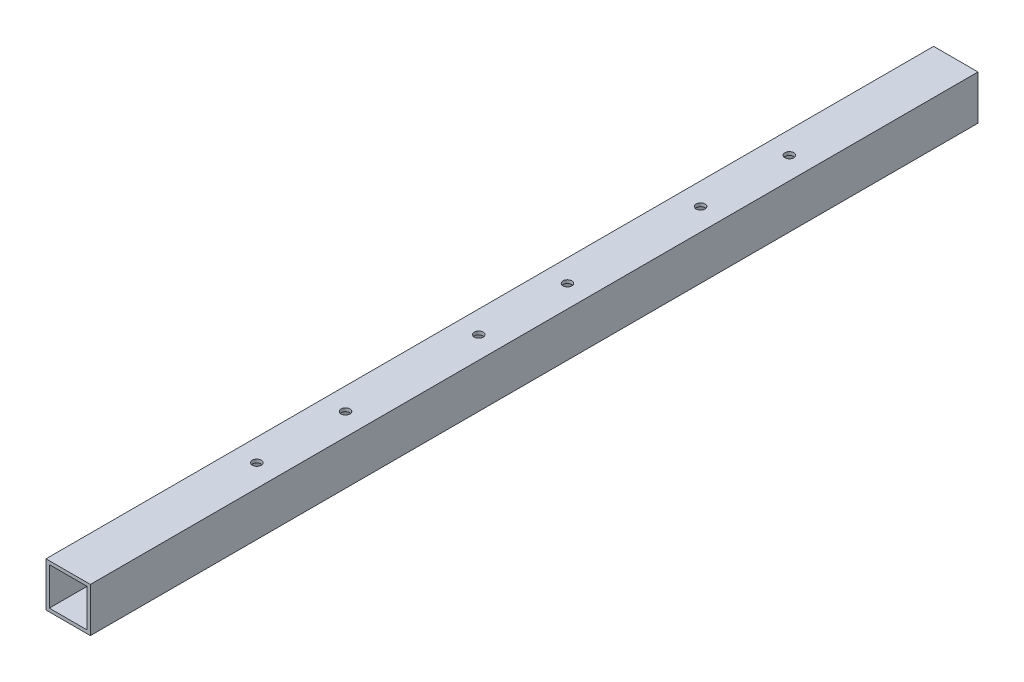
ISO-10303-21;
HEADER;
FILE_DESCRIPTION(('STEP AP214'),'2;1');
FILE_NAME('part.step','',(''),(''),'','','');
FILE_SCHEMA(('AUTOMOTIVE_DESIGN { 1 0 10303 214 1 1 1 1 }'));
ENDSEC;
DATA;
#1=APPLICATION_CONTEXT('core data for automotive mechanical design processes');
#2=APPLICATION_PROTOCOL_DEFINITION('international standard','automotive_design',2000,#1);
#3=PRODUCT_CONTEXT('',#1,'mechanical');
#4=PRODUCT('Part','Part','',(#3));
#5=PRODUCT_RELATED_PRODUCT_CATEGORY('part','',(#4));
#6=PRODUCT_DEFINITION_FORMATION('','',#4);
#7=PRODUCT_DEFINITION_CONTEXT('part definition',#1,'design');
#8=PRODUCT_DEFINITION('design','',#6,#7);
#9=PRODUCT_DEFINITION_SHAPE('','',#8);
#10=(LENGTH_UNIT() NAMED_UNIT(*) SI_UNIT(.MILLI.,.METRE.));
#11=(NAMED_UNIT(*) PLANE_ANGLE_UNIT() SI_UNIT($,.RADIAN.));
#12=(NAMED_UNIT(*) SI_UNIT($,.STERADIAN.) SOLID_ANGLE_UNIT());
#13=UNCERTAINTY_MEASURE_WITH_UNIT(LENGTH_MEASURE(1.E-05),#10,'distance_accuracy_value','');
#14=(GEOMETRIC_REPRESENTATION_CONTEXT(3) GLOBAL_UNCERTAINTY_ASSIGNED_CONTEXT((#13)) GLOBAL_UNIT_ASSIGNED_CONTEXT((#10,
#11,#12)) REPRESENTATION_CONTEXT('',''));
#15=CARTESIAN_POINT('',(0.,0.,0.));
#16=DIRECTION('',(0.,0.,1.));
#17=DIRECTION('',(1.,0.,0.));
#18=AXIS2_PLACEMENT_3D('',#15,#16,#17);
#19=CARTESIAN_POINT('',(0.,-15.,275.));
#20=DIRECTION('',(0.,1.,0.));
#21=DIRECTION('',(0.,0.,1.));
#22=AXIS2_PLACEMENT_3D('',#19,#20,#21);
#23=CYLINDRICAL_SURFACE('',#22,2.);
#24=CARTESIAN_POINT('',(0.,10.,275.));
#25=DIRECTION('',(0.,1.,0.));
#26=DIRECTION('',(0.,0.,1.));
#27=AXIS2_PLACEMENT_3D('',#24,#25,#26);
#28=CIRCLE('',#27,2.);
#29=CARTESIAN_POINT('',(0.,10.,277.));
#30=VERTEX_POINT('',#29);
#31=EDGE_CURVE('E46',#30,#30,#28,.T.);
#32=ORIENTED_EDGE('',*,*,#31,.T.);
#33=EDGE_LOOP('',(#32));
#34=FACE_BOUND('',#33,.T.);
#35=CARTESIAN_POINT('',(0.,8.5,275.));
#36=DIRECTION('',(0.,1.,0.));
#37=DIRECTION('',(0.,0.,1.));
#38=AXIS2_PLACEMENT_3D('',#35,#36,#37);
#39=CIRCLE('',#38,2.);
#40=CARTESIAN_POINT('',(0.,8.5,277.));
#41=VERTEX_POINT('',#40);
#42=EDGE_CURVE('E11',#41,#41,#39,.T.);
#43=ORIENTED_EDGE('',*,*,#42,.F.);
#44=EDGE_LOOP('',(#43));
#45=FACE_BOUND('',#44,.T.);
#46=ADVANCED_FACE('F38',(#34,#45),#23,.F.);
#47=CARTESIAN_POINT('',(0.,-15.,275.));
#48=DIRECTION('',(0.,1.,0.));
#49=DIRECTION('',(0.,0.,1.));
#50=AXIS2_PLACEMENT_3D('',#47,#48,#49);
#51=CYLINDRICAL_SURFACE('',#50,2.);
#52=CARTESIAN_POINT('',(0.,-8.5,275.));
#53=DIRECTION('',(0.,-1.,0.));
#54=DIRECTION('',(0.,0.,-1.));
#55=AXIS2_PLACEMENT_3D('',#52,#53,#54);
#56=CIRCLE('',#55,2.);
#57=CARTESIAN_POINT('',(0.,-8.5,273.));
#58=VERTEX_POINT('',#57);
#59=EDGE_CURVE('E174',#58,#58,#56,.T.);
#60=ORIENTED_EDGE('',*,*,#59,.F.);
#61=EDGE_LOOP('',(#60));
#62=FACE_BOUND('',#61,.T.);
#63=CARTESIAN_POINT('',(0.,-10.,275.));
#64=DIRECTION('',(0.,1.,0.));
#65=DIRECTION('',(0.,0.,1.));
#66=AXIS2_PLACEMENT_3D('',#63,#64,#65);
#67=CIRCLE('',#66,2.);
#68=CARTESIAN_POINT('',(0.,-10.,277.));
#69=VERTEX_POINT('',#68);
#70=EDGE_CURVE('E187',#69,#69,#67,.T.);
#71=ORIENTED_EDGE('',*,*,#70,.F.);
#72=EDGE_LOOP('',(#71));
#73=FACE_BOUND('',#72,.T.);
#74=ADVANCED_FACE('F261',(#62,#73),#51,.F.);
#75=CARTESIAN_POINT('',(10.,10.,400.));
#76=DIRECTION('',(-1.,0.,0.));
#77=DIRECTION('',(0.,0.,1.));
#78=AXIS2_PLACEMENT_3D('',#75,#76,#77);
#79=PLANE('',#78);
#80=DIRECTION('',(0.,1.,0.));
#81=VECTOR('',#80,1.);
#82=CARTESIAN_POINT('',(10.,10.,0.));
#83=LINE('',#82,#81);
#84=CARTESIAN_POINT('',(10.,-10.,0.));
#85=VERTEX_POINT('',#84);
#86=CARTESIAN_POINT('',(10.,10.,0.));
#87=VERTEX_POINT('',#86);
#88=EDGE_CURVE('E141',#85,#87,#83,.T.);
#89=ORIENTED_EDGE('',*,*,#88,.T.);
#90=DIRECTION('',(0.,0.,-1.));
#91=VECTOR('',#90,1.);
#92=CARTESIAN_POINT('',(10.,10.,400.));
#93=LINE('',#92,#91);
#94=CARTESIAN_POINT('',(10.,10.,400.));
#95=VERTEX_POINT('',#94);
#96=EDGE_CURVE('E171',#95,#87,#93,.T.);
#97=ORIENTED_EDGE('',*,*,#96,.F.);
#98=DIRECTION('',(0.,1.,0.));
#99=VECTOR('',#98,1.);
#100=CARTESIAN_POINT('',(10.,10.,400.));
#101=LINE('',#100,#99);
#102=CARTESIAN_POINT('',(10.,-10.,400.));
#103=VERTEX_POINT('',#102);
#104=EDGE_CURVE('E145',#103,#95,#101,.T.);
#105=ORIENTED_EDGE('',*,*,#104,.F.);
#106=DIRECTION('',(0.,0.,-1.));
#107=VECTOR('',#106,1.);
#108=CARTESIAN_POINT('',(10.,-10.,400.));
#109=LINE('',#108,#107);
#110=EDGE_CURVE('E155',#103,#85,#109,.T.);
#111=ORIENTED_EDGE('',*,*,#110,.T.);
#112=EDGE_LOOP('',(#89,#97,#105,#111));
#113=FACE_BOUND('',#112,.T.);
#114=ADVANCED_FACE('F266',(#113),#79,.F.);
#115=CARTESIAN_POINT('',(-10.,10.,400.));
#116=DIRECTION('',(0.,-1.,0.));
#117=DIRECTION('',(0.,0.,-1.));
#118=AXIS2_PLACEMENT_3D('',#115,#116,#117);
#119=PLANE('',#118);
#120=CARTESIAN_POINT('',(0.,10.,215.));
#121=DIRECTION('',(0.,1.,0.));
#122=DIRECTION('',(0.,0.,1.));
#123=AXIS2_PLACEMENT_3D('',#120,#121,#122);
#124=CIRCLE('',#123,2.);
#125=CARTESIAN_POINT('',(0.,10.,217.));
#126=VERTEX_POINT('',#125);
#127=EDGE_CURVE('E194',#126,#126,#124,.T.);
#128=ORIENTED_EDGE('',*,*,#127,.F.);
#129=EDGE_LOOP('',(#128));
#130=FACE_BOUND('',#129,.T.);
#131=CARTESIAN_POINT('',(0.,10.,315.));
#132=DIRECTION('',(0.,1.,0.));
#133=DIRECTION('',(0.,0.,1.));
#134=AXIS2_PLACEMENT_3D('',#131,#132,#133);
#135=CIRCLE('',#134,2.);
#136=CARTESIAN_POINT('',(0.,10.,317.));
#137=VERTEX_POINT('',#136);
#138=EDGE_CURVE('E201',#137,#137,#135,.T.);
#139=ORIENTED_EDGE('',*,*,#138,.F.);
#140=EDGE_LOOP('',(#139));
#141=FACE_BOUND('',#140,.T.);
#142=CARTESIAN_POINT('',(0.,10.,175.));
#143=DIRECTION('',(0.,1.,0.));
#144=DIRECTION('',(0.,0.,1.));
#145=AXIS2_PLACEMENT_3D('',#142,#143,#144);
#146=CIRCLE('',#145,2.);
#147=CARTESIAN_POINT('',(0.,10.,177.));
#148=VERTEX_POINT('',#147);
#149=EDGE_CURVE('E216',#148,#148,#146,.T.);
#150=ORIENTED_EDGE('',*,*,#149,.F.);
#151=EDGE_LOOP('',(#150));
#152=FACE_BOUND('',#151,.T.);
#153=CARTESIAN_POINT('',(0.,10.,115.));
#154=DIRECTION('',(0.,1.,0.));
#155=DIRECTION('',(0.,0.,1.));
#156=AXIS2_PLACEMENT_3D('',#153,#154,#155);
#157=CIRCLE('',#156,2.);
#158=CARTESIAN_POINT('',(0.,10.,117.));
#159=VERTEX_POINT('',#158);
#160=EDGE_CURVE('E184',#159,#159,#157,.T.);
#161=ORIENTED_EDGE('',*,*,#160,.F.);
#162=EDGE_LOOP('',(#161));
#163=FACE_BOUND('',#162,.T.);
#164=CARTESIAN_POINT('',(0.,10.,75.));
#165=DIRECTION('',(0.,1.,0.));
#166=DIRECTION('',(0.,0.,1.));
#167=AXIS2_PLACEMENT_3D('',#164,#165,#166);
#168=CIRCLE('',#167,2.);
#169=CARTESIAN_POINT('',(0.,10.,77.));
#170=VERTEX_POINT('',#169);
#171=EDGE_CURVE('E179',#170,#170,#168,.T.);
#172=ORIENTED_EDGE('',*,*,#171,.F.);
#173=EDGE_LOOP('',(#172));
#174=FACE_BOUND('',#173,.T.);
#175=DIRECTION('',(-1.,0.,0.));
#176=VECTOR('',#175,1.);
#177=CARTESIAN_POINT('',(-10.,10.,0.));
#178=LINE('',#177,#176);
#179=CARTESIAN_POINT('',(-10.,10.,0.));
#180=VERTEX_POINT('',#179);
#181=EDGE_CURVE('E158',#87,#180,#178,.T.);
#182=ORIENTED_EDGE('',*,*,#181,.T.);
#183=DIRECTION('',(0.,0.,-1.));
#184=VECTOR('',#183,1.);
#185=CARTESIAN_POINT('',(-10.,10.,400.));
#186=LINE('',#185,#184);
#187=CARTESIAN_POINT('',(-10.,10.,400.));
#188=VERTEX_POINT('',#187);
#189=EDGE_CURVE('E168',#188,#180,#186,.T.);
#190=ORIENTED_EDGE('',*,*,#189,.F.);
#191=DIRECTION('',(-1.,0.,0.));
#192=VECTOR('',#191,1.);
#193=CARTESIAN_POINT('',(-10.,10.,400.));
#194=LINE('',#193,#192);
#195=EDGE_CURVE('E148',#95,#188,#194,.T.);
#196=ORIENTED_EDGE('',*,*,#195,.F.);
#197=ORIENTED_EDGE('',*,*,#96,.T.);
#198=EDGE_LOOP('',(#182,#190,#196,#197));
#199=FACE_BOUND('',#198,.T.);
#200=ORIENTED_EDGE('',*,*,#31,.F.);
#201=EDGE_LOOP('',(#200));
#202=FACE_BOUND('',#201,.T.);
#203=ADVANCED_FACE('F296',(#130,#141,#152,#163,#174,#199,#202),#119,.F.);
#204=CARTESIAN_POINT('',(-10.,10.,400.));
#205=DIRECTION('',(1.,0.,0.));
#206=DIRECTION('',(0.,0.,-1.));
#207=AXIS2_PLACEMENT_3D('',#204,#205,#206);
#208=PLANE('',#207);
#209=DIRECTION('',(0.,-1.,0.));
#210=VECTOR('',#209,1.);
#211=CARTESIAN_POINT('',(-10.,10.,0.));
#212=LINE('',#211,#210);
#213=CARTESIAN_POINT('',(-10.,-10.,0.));
#214=VERTEX_POINT('',#213);
#215=EDGE_CURVE('E160',#180,#214,#212,.T.);
#216=ORIENTED_EDGE('',*,*,#215,.T.);
#217=DIRECTION('',(0.,0.,-1.));
#218=VECTOR('',#217,1.);
#219=CARTESIAN_POINT('',(-10.,-10.,400.));
#220=LINE('',#219,#218);
#221=CARTESIAN_POINT('',(-10.,-10.,400.));
#222=VERTEX_POINT('',#221);
#223=EDGE_CURVE('E165',#222,#214,#220,.T.);
#224=ORIENTED_EDGE('',*,*,#223,.F.);
#225=DIRECTION('',(0.,-1.,0.));
#226=VECTOR('',#225,1.);
#227=CARTESIAN_POINT('',(-10.,10.,400.));
#228=LINE('',#227,#226);
#229=EDGE_CURVE('E151',#188,#222,#228,.T.);
#230=ORIENTED_EDGE('',*,*,#229,.F.);
#231=ORIENTED_EDGE('',*,*,#189,.T.);
#232=EDGE_LOOP('',(#216,#224,#230,#231));
#233=FACE_BOUND('',#232,.T.);
#234=ADVANCED_FACE('F292',(#233),#208,.F.);
#235=CARTESIAN_POINT('',(-10.,-10.,400.));
#236=DIRECTION('',(0.,1.,0.));
#237=DIRECTION('',(0.,0.,1.));
#238=AXIS2_PLACEMENT_3D('',#235,#236,#237);
#239=PLANE('',#238);
#240=CARTESIAN_POINT('',(0.,-10.,215.));
#241=DIRECTION('',(0.,1.,0.));
#242=DIRECTION('',(0.,0.,1.));
#243=AXIS2_PLACEMENT_3D('',#240,#241,#242);
#244=CIRCLE('',#243,2.);
#245=CARTESIAN_POINT('',(0.,-10.,217.));
#246=VERTEX_POINT('',#245);
#247=EDGE_CURVE('E213',#246,#246,#244,.T.);
#248=ORIENTED_EDGE('',*,*,#247,.T.);
#249=EDGE_LOOP('',(#248));
#250=FACE_BOUND('',#249,.T.);
#251=CARTESIAN_POINT('',(0.,-10.,315.));
#252=DIRECTION('',(0.,1.,0.));
#253=DIRECTION('',(0.,0.,1.));
#254=AXIS2_PLACEMENT_3D('',#251,#252,#253);
#255=CIRCLE('',#254,2.);
#256=CARTESIAN_POINT('',(0.,-10.,317.));
#257=VERTEX_POINT('',#256);
#258=EDGE_CURVE('E198',#257,#257,#255,.T.);
#259=ORIENTED_EDGE('',*,*,#258,.T.);
#260=EDGE_LOOP('',(#259));
#261=FACE_BOUND('',#260,.T.);
#262=CARTESIAN_POINT('',(0.,-10.,175.));
#263=DIRECTION('',(0.,1.,0.));
#264=DIRECTION('',(0.,0.,1.));
#265=AXIS2_PLACEMENT_3D('',#262,#263,#264);
#266=CIRCLE('',#265,2.);
#267=CARTESIAN_POINT('',(0.,-10.,177.));
#268=VERTEX_POINT('',#267);
#269=EDGE_CURVE('E225',#268,#268,#266,.T.);
#270=ORIENTED_EDGE('',*,*,#269,.T.);
#271=EDGE_LOOP('',(#270));
#272=FACE_BOUND('',#271,.T.);
#273=CARTESIAN_POINT('',(0.,-10.,115.));
#274=DIRECTION('',(0.,1.,0.));
#275=DIRECTION('',(0.,0.,1.));
#276=AXIS2_PLACEMENT_3D('',#273,#274,#275);
#277=CIRCLE('',#276,2.);
#278=CARTESIAN_POINT('',(0.,-10.,117.));
#279=VERTEX_POINT('',#278);
#280=EDGE_CURVE('E232',#279,#279,#277,.T.);
#281=ORIENTED_EDGE('',*,*,#280,.T.);
#282=EDGE_LOOP('',(#281));
#283=FACE_BOUND('',#282,.T.);
#284=CARTESIAN_POINT('',(0.,-10.,75.));
#285=DIRECTION('',(0.,1.,0.));
#286=DIRECTION('',(0.,0.,1.));
#287=AXIS2_PLACEMENT_3D('',#284,#285,#286);
#288=CIRCLE('',#287,2.);
#289=CARTESIAN_POINT('',(0.,-10.,77.));
#290=VERTEX_POINT('',#289);
#291=EDGE_CURVE('E129',#290,#290,#288,.T.);
#292=ORIENTED_EDGE('',*,*,#291,.T.);
#293=EDGE_LOOP('',(#292));
#294=FACE_BOUND('',#293,.T.);
#295=DIRECTION('',(1.,0.,0.));
#296=VECTOR('',#295,1.);
#297=CARTESIAN_POINT('',(-10.,-10.,0.));
#298=LINE('',#297,#296);
#299=EDGE_CURVE('E149',#214,#85,#298,.T.);
#300=ORIENTED_EDGE('',*,*,#299,.T.);
#301=ORIENTED_EDGE('',*,*,#110,.F.);
#302=DIRECTION('',(1.,0.,0.));
#303=VECTOR('',#302,1.);
#304=CARTESIAN_POINT('',(-10.,-10.,400.));
#305=LINE('',#304,#303);
#306=EDGE_CURVE('E153',#222,#103,#305,.T.);
#307=ORIENTED_EDGE('',*,*,#306,.F.);
#308=ORIENTED_EDGE('',*,*,#223,.T.);
#309=EDGE_LOOP('',(#300,#301,#307,#308));
#310=FACE_BOUND('',#309,.T.);
#311=ORIENTED_EDGE('',*,*,#70,.T.);
#312=EDGE_LOOP('',(#311));
#313=FACE_BOUND('',#312,.T.);
#314=ADVANCED_FACE('F242',(#250,#261,#272,#283,#294,#310,#313),#239,.F.);
#315=CARTESIAN_POINT('',(0.,0.,400.));
#316=DIRECTION('',(0.,0.,1.));
#317=DIRECTION('',(1.,0.,0.));
#318=AXIS2_PLACEMENT_3D('',#315,#316,#317);
#319=PLANE('',#318);
#320=DIRECTION('',(0.,1.,0.));
#321=VECTOR('',#320,1.);
#322=CARTESIAN_POINT('',(-8.5,8.5,400.));
#323=LINE('',#322,#321);
#324=CARTESIAN_POINT('',(-8.5,-8.5,400.));
#325=VERTEX_POINT('',#324);
#326=CARTESIAN_POINT('',(-8.5,8.5,400.));
#327=VERTEX_POINT('',#326);
#328=EDGE_CURVE('E106',#325,#327,#323,.T.);
#329=ORIENTED_EDGE('',*,*,#328,.T.);
#330=DIRECTION('',(1.,0.,0.));
#331=VECTOR('',#330,1.);
#332=CARTESIAN_POINT('',(8.5,8.5,400.));
#333=LINE('',#332,#331);
#334=CARTESIAN_POINT('',(8.5,8.5,400.));
#335=VERTEX_POINT('',#334);
#336=EDGE_CURVE('E115',#327,#335,#333,.T.);
#337=ORIENTED_EDGE('',*,*,#336,.T.);
#338=DIRECTION('',(0.,-1.,0.));
#339=VECTOR('',#338,1.);
#340=CARTESIAN_POINT('',(8.5,8.5,400.));
#341=LINE('',#340,#339);
#342=CARTESIAN_POINT('',(8.5,-8.5,400.));
#343=VERTEX_POINT('',#342);
#344=EDGE_CURVE('E54',#335,#343,#341,.T.);
#345=ORIENTED_EDGE('',*,*,#344,.T.);
#346=DIRECTION('',(-1.,0.,0.));
#347=VECTOR('',#346,1.);
#348=CARTESIAN_POINT('',(8.5,-8.5,400.));
#349=LINE('',#348,#347);
#350=EDGE_CURVE('E112',#343,#325,#349,.T.);
#351=ORIENTED_EDGE('',*,*,#350,.T.);
#352=EDGE_LOOP('',(#329,#337,#345,#351));
#353=FACE_BOUND('',#352,.T.);
#354=ORIENTED_EDGE('',*,*,#104,.T.);
#355=ORIENTED_EDGE('',*,*,#195,.T.);
#356=ORIENTED_EDGE('',*,*,#229,.T.);
#357=ORIENTED_EDGE('',*,*,#306,.T.);
#358=EDGE_LOOP('',(#354,#355,#356,#357));
#359=FACE_BOUND('',#358,.T.);
#360=ADVANCED_FACE('F120',(#353,#359),#319,.T.);
#361=CARTESIAN_POINT('',(0.,0.,0.));
#362=DIRECTION('',(0.,0.,1.));
#363=DIRECTION('',(1.,0.,0.));
#364=AXIS2_PLACEMENT_3D('',#361,#362,#363);
#365=PLANE('',#364);
#366=DIRECTION('',(1.,0.,0.));
#367=VECTOR('',#366,1.);
#368=CARTESIAN_POINT('',(8.5,8.5,0.));
#369=LINE('',#368,#367);
#370=CARTESIAN_POINT('',(-8.5,8.5,0.));
#371=VERTEX_POINT('',#370);
#372=CARTESIAN_POINT('',(8.5,8.5,0.));
#373=VERTEX_POINT('',#372);
#374=EDGE_CURVE('E135',#371,#373,#369,.T.);
#375=ORIENTED_EDGE('',*,*,#374,.F.);
#376=DIRECTION('',(0.,1.,0.));
#377=VECTOR('',#376,1.);
#378=CARTESIAN_POINT('',(-8.5,8.5,0.));
#379=LINE('',#378,#377);
#380=CARTESIAN_POINT('',(-8.5,-8.5,0.));
#381=VERTEX_POINT('',#380);
#382=EDGE_CURVE('E62',#381,#371,#379,.T.);
#383=ORIENTED_EDGE('',*,*,#382,.F.);
#384=DIRECTION('',(-1.,0.,0.));
#385=VECTOR('',#384,1.);
#386=CARTESIAN_POINT('',(8.5,-8.5,0.));
#387=LINE('',#386,#385);
#388=CARTESIAN_POINT('',(8.5,-8.5,0.));
#389=VERTEX_POINT('',#388);
#390=EDGE_CURVE('E123',#389,#381,#387,.T.);
#391=ORIENTED_EDGE('',*,*,#390,.F.);
#392=DIRECTION('',(0.,-1.,0.));
#393=VECTOR('',#392,1.);
#394=CARTESIAN_POINT('',(8.5,8.5,0.));
#395=LINE('',#394,#393);
#396=EDGE_CURVE('E126',#373,#389,#395,.T.);
#397=ORIENTED_EDGE('',*,*,#396,.F.);
#398=EDGE_LOOP('',(#375,#383,#391,#397));
#399=FACE_BOUND('',#398,.T.);
#400=ORIENTED_EDGE('',*,*,#88,.F.);
#401=ORIENTED_EDGE('',*,*,#299,.F.);
#402=ORIENTED_EDGE('',*,*,#215,.F.);
#403=ORIENTED_EDGE('',*,*,#181,.F.);
#404=EDGE_LOOP('',(#400,#401,#402,#403));
#405=FACE_BOUND('',#404,.T.);
#406=ADVANCED_FACE('F284',(#399,#405),#365,.F.);
#407=CARTESIAN_POINT('',(-8.5,8.5,400.));
#408=DIRECTION('',(-1.,0.,0.));
#409=DIRECTION('',(0.,0.,1.));
#410=AXIS2_PLACEMENT_3D('',#407,#408,#409);
#411=PLANE('',#410);
#412=ORIENTED_EDGE('',*,*,#382,.T.);
#413=DIRECTION('',(0.,0.,-1.));
#414=VECTOR('',#413,1.);
#415=CARTESIAN_POINT('',(-8.5,8.5,400.));
#416=LINE('',#415,#414);
#417=EDGE_CURVE('E102',#327,#371,#416,.T.);
#418=ORIENTED_EDGE('',*,*,#417,.F.);
#419=ORIENTED_EDGE('',*,*,#328,.F.);
#420=DIRECTION('',(0.,0.,-1.));
#421=VECTOR('',#420,1.);
#422=CARTESIAN_POINT('',(-8.5,-8.5,400.));
#423=LINE('',#422,#421);
#424=EDGE_CURVE('E139',#325,#381,#423,.T.);
#425=ORIENTED_EDGE('',*,*,#424,.T.);
#426=EDGE_LOOP('',(#412,#418,#419,#425));
#427=FACE_BOUND('',#426,.T.);
#428=ADVANCED_FACE('F104',(#427),#411,.F.);
#429=CARTESIAN_POINT('',(8.5,-8.5,400.));
#430=DIRECTION('',(0.,-1.,0.));
#431=DIRECTION('',(0.,0.,-1.));
#432=AXIS2_PLACEMENT_3D('',#429,#430,#431);
#433=PLANE('',#432);
#434=CARTESIAN_POINT('',(0.,-8.5,215.));
#435=DIRECTION('',(0.,-1.,0.));
#436=DIRECTION('',(0.,0.,-1.));
#437=AXIS2_PLACEMENT_3D('',#434,#435,#436);
#438=CIRCLE('',#437,2.);
#439=CARTESIAN_POINT('',(0.,-8.5,213.));
#440=VERTEX_POINT('',#439);
#441=EDGE_CURVE('E210',#440,#440,#438,.T.);
#442=ORIENTED_EDGE('',*,*,#441,.T.);
#443=EDGE_LOOP('',(#442));
#444=FACE_BOUND('',#443,.T.);
#445=CARTESIAN_POINT('',(0.,-8.5,315.));
#446=DIRECTION('',(0.,-1.,0.));
#447=DIRECTION('',(0.,0.,-1.));
#448=AXIS2_PLACEMENT_3D('',#445,#446,#447);
#449=CIRCLE('',#448,2.);
#450=CARTESIAN_POINT('',(0.,-8.5,313.));
#451=VERTEX_POINT('',#450);
#452=EDGE_CURVE('E193',#451,#451,#449,.T.);
#453=ORIENTED_EDGE('',*,*,#452,.T.);
#454=EDGE_LOOP('',(#453));
#455=FACE_BOUND('',#454,.T.);
#456=CARTESIAN_POINT('',(0.,-8.5,175.));
#457=DIRECTION('',(0.,-1.,0.));
#458=DIRECTION('',(0.,0.,-1.));
#459=AXIS2_PLACEMENT_3D('',#456,#457,#458);
#460=CIRCLE('',#459,2.);
#461=CARTESIAN_POINT('',(0.,-8.5,173.));
#462=VERTEX_POINT('',#461);
#463=EDGE_CURVE('E222',#462,#462,#460,.T.);
#464=ORIENTED_EDGE('',*,*,#463,.T.);
#465=EDGE_LOOP('',(#464));
#466=FACE_BOUND('',#465,.T.);
#467=CARTESIAN_POINT('',(0.,-8.5,115.));
#468=DIRECTION('',(0.,-1.,0.));
#469=DIRECTION('',(0.,0.,-1.));
#470=AXIS2_PLACEMENT_3D('',#467,#468,#469);
#471=CIRCLE('',#470,2.);
#472=CARTESIAN_POINT('',(0.,-8.5,113.));
#473=VERTEX_POINT('',#472);
#474=EDGE_CURVE('E183',#473,#473,#471,.T.);
#475=ORIENTED_EDGE('',*,*,#474,.T.);
#476=EDGE_LOOP('',(#475));
#477=FACE_BOUND('',#476,.T.);
#478=CARTESIAN_POINT('',(0.,-8.5,75.));
#479=DIRECTION('',(0.,-1.,0.));
#480=DIRECTION('',(0.,0.,-1.));
#481=AXIS2_PLACEMENT_3D('',#478,#479,#480);
#482=CIRCLE('',#481,2.);
#483=CARTESIAN_POINT('',(0.,-8.5,73.));
#484=VERTEX_POINT('',#483);
#485=EDGE_CURVE('E178',#484,#484,#482,.T.);
#486=ORIENTED_EDGE('',*,*,#485,.T.);
#487=EDGE_LOOP('',(#486));
#488=FACE_BOUND('',#487,.T.);
#489=ORIENTED_EDGE('',*,*,#390,.T.);
#490=ORIENTED_EDGE('',*,*,#424,.F.);
#491=ORIENTED_EDGE('',*,*,#350,.F.);
#492=DIRECTION('',(0.,0.,-1.));
#493=VECTOR('',#492,1.);
#494=CARTESIAN_POINT('',(8.5,-8.5,400.));
#495=LINE('',#494,#493);
#496=EDGE_CURVE('E142',#343,#389,#495,.T.);
#497=ORIENTED_EDGE('',*,*,#496,.T.);
#498=EDGE_LOOP('',(#489,#490,#491,#497));
#499=FACE_BOUND('',#498,.T.);
#500=ORIENTED_EDGE('',*,*,#59,.T.);
#501=EDGE_LOOP('',(#500));
#502=FACE_BOUND('',#501,.T.);
#503=ADVANCED_FACE('F278',(#444,#455,#466,#477,#488,#499,#502),#433,.F.);
#504=CARTESIAN_POINT('',(8.5,8.5,400.));
#505=DIRECTION('',(1.,0.,0.));
#506=DIRECTION('',(0.,0.,-1.));
#507=AXIS2_PLACEMENT_3D('',#504,#505,#506);
#508=PLANE('',#507);
#509=ORIENTED_EDGE('',*,*,#396,.T.);
#510=ORIENTED_EDGE('',*,*,#496,.F.);
#511=ORIENTED_EDGE('',*,*,#344,.F.);
#512=DIRECTION('',(0.,0.,-1.));
#513=VECTOR('',#512,1.);
#514=CARTESIAN_POINT('',(8.5,8.5,400.));
#515=LINE('',#514,#513);
#516=EDGE_CURVE('E111',#335,#373,#515,.T.);
#517=ORIENTED_EDGE('',*,*,#516,.T.);
#518=EDGE_LOOP('',(#509,#510,#511,#517));
#519=FACE_BOUND('',#518,.T.);
#520=ADVANCED_FACE('F272',(#519),#508,.F.);
#521=CARTESIAN_POINT('',(8.5,8.5,400.));
#522=DIRECTION('',(0.,1.,0.));
#523=DIRECTION('',(0.,0.,1.));
#524=AXIS2_PLACEMENT_3D('',#521,#522,#523);
#525=PLANE('',#524);
#526=CARTESIAN_POINT('',(0.,8.5,215.));
#527=DIRECTION('',(0.,1.,0.));
#528=DIRECTION('',(0.,0.,1.));
#529=AXIS2_PLACEMENT_3D('',#526,#527,#528);
#530=CIRCLE('',#529,2.);
#531=CARTESIAN_POINT('',(0.,8.5,217.));
#532=VERTEX_POINT('',#531);
#533=EDGE_CURVE('E41',#532,#532,#530,.T.);
#534=ORIENTED_EDGE('',*,*,#533,.T.);
#535=EDGE_LOOP('',(#534));
#536=FACE_BOUND('',#535,.T.);
#537=CARTESIAN_POINT('',(0.,8.5,315.));
#538=DIRECTION('',(0.,1.,0.));
#539=DIRECTION('',(0.,0.,1.));
#540=AXIS2_PLACEMENT_3D('',#537,#538,#539);
#541=CIRCLE('',#540,2.);
#542=CARTESIAN_POINT('',(0.,8.5,317.));
#543=VERTEX_POINT('',#542);
#544=EDGE_CURVE('E191',#543,#543,#541,.T.);
#545=ORIENTED_EDGE('',*,*,#544,.T.);
#546=EDGE_LOOP('',(#545));
#547=FACE_BOUND('',#546,.T.);
#548=CARTESIAN_POINT('',(0.,8.5,175.));
#549=DIRECTION('',(0.,1.,0.));
#550=DIRECTION('',(0.,0.,1.));
#551=AXIS2_PLACEMENT_3D('',#548,#549,#550);
#552=CIRCLE('',#551,2.);
#553=CARTESIAN_POINT('',(0.,8.5,177.));
#554=VERTEX_POINT('',#553);
#555=EDGE_CURVE('E219',#554,#554,#552,.T.);
#556=ORIENTED_EDGE('',*,*,#555,.T.);
#557=EDGE_LOOP('',(#556));
#558=FACE_BOUND('',#557,.T.);
#559=CARTESIAN_POINT('',(0.,8.5,115.));
#560=DIRECTION('',(0.,1.,0.));
#561=DIRECTION('',(0.,0.,1.));
#562=AXIS2_PLACEMENT_3D('',#559,#560,#561);
#563=CIRCLE('',#562,2.);
#564=CARTESIAN_POINT('',(0.,8.5,117.));
#565=VERTEX_POINT('',#564);
#566=EDGE_CURVE('E180',#565,#565,#563,.T.);
#567=ORIENTED_EDGE('',*,*,#566,.T.);
#568=EDGE_LOOP('',(#567));
#569=FACE_BOUND('',#568,.T.);
#570=CARTESIAN_POINT('',(0.,8.5,75.));
#571=DIRECTION('',(0.,1.,0.));
#572=DIRECTION('',(0.,0.,1.));
#573=AXIS2_PLACEMENT_3D('',#570,#571,#572);
#574=CIRCLE('',#573,2.);
#575=CARTESIAN_POINT('',(0.,8.5,77.));
#576=VERTEX_POINT('',#575);
#577=EDGE_CURVE('E175',#576,#576,#574,.T.);
#578=ORIENTED_EDGE('',*,*,#577,.T.);
#579=EDGE_LOOP('',(#578));
#580=FACE_BOUND('',#579,.T.);
#581=ORIENTED_EDGE('',*,*,#374,.T.);
#582=ORIENTED_EDGE('',*,*,#516,.F.);
#583=ORIENTED_EDGE('',*,*,#336,.F.);
#584=ORIENTED_EDGE('',*,*,#417,.T.);
#585=EDGE_LOOP('',(#581,#582,#583,#584));
#586=FACE_BOUND('',#585,.T.);
#587=ORIENTED_EDGE('',*,*,#42,.T.);
#588=EDGE_LOOP('',(#587));
#589=FACE_BOUND('',#588,.T.);
#590=ADVANCED_FACE('F116',(#536,#547,#558,#569,#580,#586,#589),#525,.F.);
#591=CARTESIAN_POINT('',(0.,-15.,75.));
#592=DIRECTION('',(0.,1.,0.));
#593=DIRECTION('',(0.,0.,1.));
#594=AXIS2_PLACEMENT_3D('',#591,#592,#593);
#595=CYLINDRICAL_SURFACE('',#594,2.);
#596=ORIENTED_EDGE('',*,*,#171,.T.);
#597=EDGE_LOOP('',(#596));
#598=FACE_BOUND('',#597,.T.);
#599=ORIENTED_EDGE('',*,*,#577,.F.);
#600=EDGE_LOOP('',(#599));
#601=FACE_BOUND('',#600,.T.);
#602=ADVANCED_FACE('F248',(#598,#601),#595,.F.);
#603=ORIENTED_EDGE('',*,*,#485,.F.);
#604=EDGE_LOOP('',(#603));
#605=FACE_BOUND('',#604,.T.);
#606=ORIENTED_EDGE('',*,*,#291,.F.);
#607=EDGE_LOOP('',(#606));
#608=FACE_BOUND('',#607,.T.);
#609=ADVANCED_FACE('F245',(#605,#608),#595,.F.);
#610=CARTESIAN_POINT('',(0.,-15.,115.));
#611=DIRECTION('',(0.,1.,0.));
#612=DIRECTION('',(0.,0.,1.));
#613=AXIS2_PLACEMENT_3D('',#610,#611,#612);
#614=CYLINDRICAL_SURFACE('',#613,2.);
#615=ORIENTED_EDGE('',*,*,#160,.T.);
#616=EDGE_LOOP('',(#615));
#617=FACE_BOUND('',#616,.T.);
#618=ORIENTED_EDGE('',*,*,#566,.F.);
#619=EDGE_LOOP('',(#618));
#620=FACE_BOUND('',#619,.T.);
#621=ADVANCED_FACE('F247',(#617,#620),#614,.F.);
#622=ORIENTED_EDGE('',*,*,#474,.F.);
#623=EDGE_LOOP('',(#622));
#624=FACE_BOUND('',#623,.T.);
#625=ORIENTED_EDGE('',*,*,#280,.F.);
#626=EDGE_LOOP('',(#625));
#627=FACE_BOUND('',#626,.T.);
#628=ADVANCED_FACE('F255',(#624,#627),#614,.F.);
#629=CARTESIAN_POINT('',(0.,-15.,175.));
#630=DIRECTION('',(0.,1.,0.));
#631=DIRECTION('',(0.,0.,1.));
#632=AXIS2_PLACEMENT_3D('',#629,#630,#631);
#633=CYLINDRICAL_SURFACE('',#632,2.);
#634=ORIENTED_EDGE('',*,*,#463,.F.);
#635=EDGE_LOOP('',(#634));
#636=FACE_BOUND('',#635,.T.);
#637=ORIENTED_EDGE('',*,*,#269,.F.);
#638=EDGE_LOOP('',(#637));
#639=FACE_BOUND('',#638,.T.);
#640=ADVANCED_FACE('F382',(#636,#639),#633,.F.);
#641=CARTESIAN_POINT('',(0.,-15.,175.));
#642=DIRECTION('',(0.,1.,0.));
#643=DIRECTION('',(0.,0.,1.));
#644=AXIS2_PLACEMENT_3D('',#641,#642,#643);
#645=CYLINDRICAL_SURFACE('',#644,2.);
#646=ORIENTED_EDGE('',*,*,#149,.T.);
#647=EDGE_LOOP('',(#646));
#648=FACE_BOUND('',#647,.T.);
#649=ORIENTED_EDGE('',*,*,#555,.F.);
#650=EDGE_LOOP('',(#649));
#651=FACE_BOUND('',#650,.T.);
#652=ADVANCED_FACE('F401',(#648,#651),#645,.F.);
#653=CARTESIAN_POINT('',(0.,-15.,315.));
#654=DIRECTION('',(0.,1.,0.));
#655=DIRECTION('',(0.,0.,1.));
#656=AXIS2_PLACEMENT_3D('',#653,#654,#655);
#657=CYLINDRICAL_SURFACE('',#656,2.);
#658=ORIENTED_EDGE('',*,*,#138,.T.);
#659=EDGE_LOOP('',(#658));
#660=FACE_BOUND('',#659,.T.);
#661=ORIENTED_EDGE('',*,*,#544,.F.);
#662=EDGE_LOOP('',(#661));
#663=FACE_BOUND('',#662,.T.);
#664=ADVANCED_FACE('F410',(#660,#663),#657,.F.);
#665=CARTESIAN_POINT('',(0.,-15.,215.));
#666=DIRECTION('',(0.,1.,0.));
#667=DIRECTION('',(0.,0.,1.));
#668=AXIS2_PLACEMENT_3D('',#665,#666,#667);
#669=CYLINDRICAL_SURFACE('',#668,2.);
#670=ORIENTED_EDGE('',*,*,#127,.T.);
#671=EDGE_LOOP('',(#670));
#672=FACE_BOUND('',#671,.T.);
#673=ORIENTED_EDGE('',*,*,#533,.F.);
#674=EDGE_LOOP('',(#673));
#675=FACE_BOUND('',#674,.T.);
#676=ADVANCED_FACE('F419',(#672,#675),#669,.F.);
#677=ORIENTED_EDGE('',*,*,#452,.F.);
#678=EDGE_LOOP('',(#677));
#679=FACE_BOUND('',#678,.T.);
#680=ORIENTED_EDGE('',*,*,#258,.F.);
#681=EDGE_LOOP('',(#680));
#682=FACE_BOUND('',#681,.T.);
#683=ADVANCED_FACE('F422',(#679,#682),#657,.F.);
#684=ORIENTED_EDGE('',*,*,#441,.F.);
#685=EDGE_LOOP('',(#684));
#686=FACE_BOUND('',#685,.T.);
#687=ORIENTED_EDGE('',*,*,#247,.F.);
#688=EDGE_LOOP('',(#687));
#689=FACE_BOUND('',#688,.T.);
#690=ADVANCED_FACE('F430',(#686,#689),#669,.F.);
#691=CLOSED_SHELL('',(#46,#74,#114,#203,#234,#314,#360,#406,#428,#503,#520,#590,#602,#609,#621,
#628,#640,#652,#664,#676,#683,#690));
#692=MANIFOLD_SOLID_BREP('B2',#691);
#693=ADVANCED_BREP_SHAPE_REPRESENTATION('',(#18,#692),#14);
#694=SHAPE_DEFINITION_REPRESENTATION(#9,#693);
ENDSEC;
END-ISO-10303-21;
